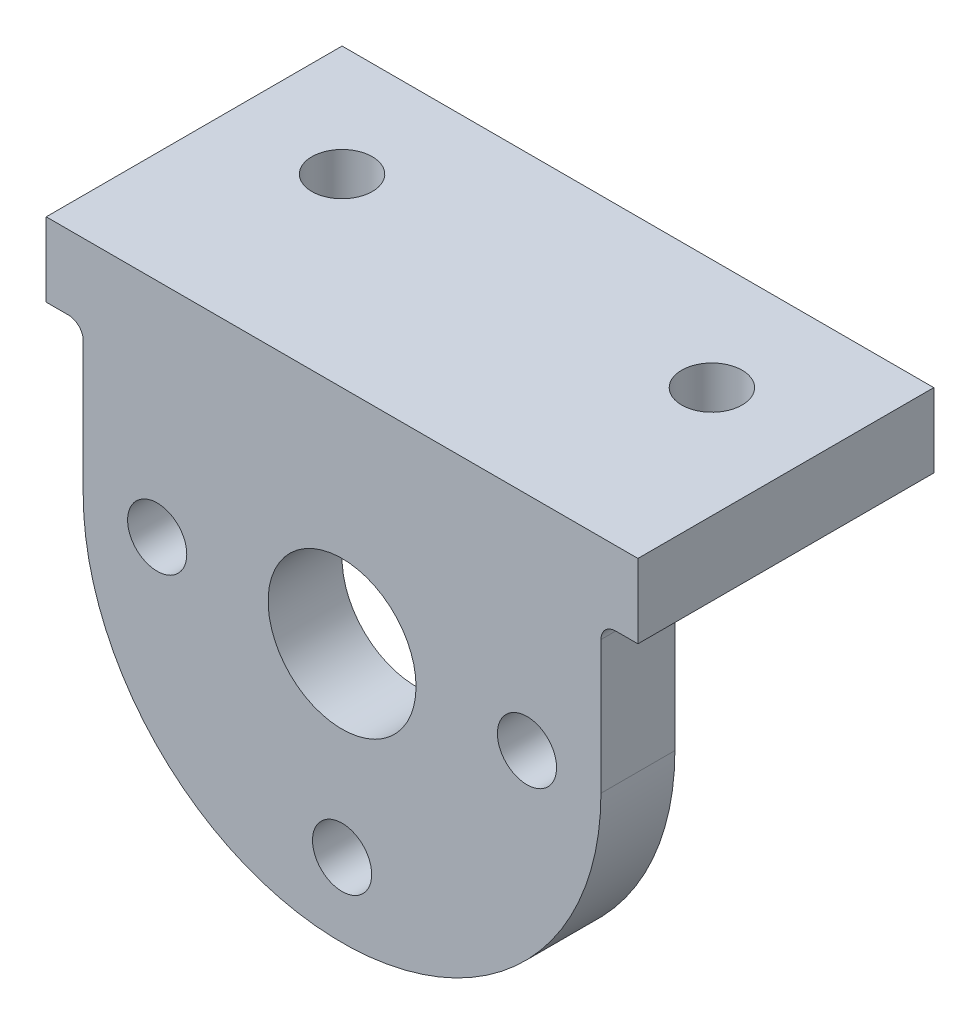
ISO-10303-21;
HEADER;
FILE_DESCRIPTION(('STEP AP214'),'2;1');
FILE_NAME('part.step','',(''),(''),'','','');
FILE_SCHEMA(('AUTOMOTIVE_DESIGN { 1 0 10303 214 1 1 1 1 }'));
ENDSEC;
DATA;
#1=APPLICATION_CONTEXT('core data for automotive mechanical design processes');
#2=APPLICATION_PROTOCOL_DEFINITION('international standard','automotive_design',2000,#1);
#3=PRODUCT_CONTEXT('',#1,'mechanical');
#4=PRODUCT('Part','Part','',(#3));
#5=PRODUCT_RELATED_PRODUCT_CATEGORY('part','',(#4));
#6=PRODUCT_DEFINITION_FORMATION('','',#4);
#7=PRODUCT_DEFINITION_CONTEXT('part definition',#1,'design');
#8=PRODUCT_DEFINITION('design','',#6,#7);
#9=PRODUCT_DEFINITION_SHAPE('','',#8);
#10=(LENGTH_UNIT() NAMED_UNIT(*) SI_UNIT(.MILLI.,.METRE.));
#11=(NAMED_UNIT(*) PLANE_ANGLE_UNIT() SI_UNIT($,.RADIAN.));
#12=(NAMED_UNIT(*) SI_UNIT($,.STERADIAN.) SOLID_ANGLE_UNIT());
#13=UNCERTAINTY_MEASURE_WITH_UNIT(LENGTH_MEASURE(1.E-05),#10,'distance_accuracy_value','');
#14=(GEOMETRIC_REPRESENTATION_CONTEXT(3) GLOBAL_UNCERTAINTY_ASSIGNED_CONTEXT((#13)) GLOBAL_UNIT_ASSIGNED_CONTEXT((#10,
#11,#12)) REPRESENTATION_CONTEXT('',''));
#15=CARTESIAN_POINT('',(0.,0.,0.));
#16=DIRECTION('',(0.,0.,1.));
#17=DIRECTION('',(1.,0.,0.));
#18=AXIS2_PLACEMENT_3D('',#15,#16,#17);
#19=CARTESIAN_POINT('',(-44.45,0.,12.7));
#20=DIRECTION('',(1.,0.,0.));
#21=DIRECTION('',(0.,1.,0.));
#22=AXIS2_PLACEMENT_3D('',#19,#20,#21);
#23=PLANE('',#22);
#24=DIRECTION('',(0.,-1.,0.));
#25=VECTOR('',#24,1.);
#26=CARTESIAN_POINT('',(-44.45,0.,12.7));
#27=LINE('',#26,#25);
#28=CARTESIAN_POINT('',(-44.45,-15.24,12.7));
#29=VERTEX_POINT('',#28);
#30=CARTESIAN_POINT('',(-44.45,-38.1,12.7));
#31=VERTEX_POINT('',#30);
#32=EDGE_CURVE('E172',#29,#31,#27,.T.);
#33=ORIENTED_EDGE('',*,*,#32,.F.);
#34=DIRECTION('',(0.,0.,-1.));
#35=VECTOR('',#34,1.);
#36=CARTESIAN_POINT('',(-44.45,-15.24,0.));
#37=LINE('',#36,#35);
#38=CARTESIAN_POINT('',(-44.45,-15.24,0.));
#39=VERTEX_POINT('',#38);
#40=EDGE_CURVE('E69',#29,#39,#37,.T.);
#41=ORIENTED_EDGE('',*,*,#40,.T.);
#42=DIRECTION('',(0.,-1.,0.));
#43=VECTOR('',#42,1.);
#44=CARTESIAN_POINT('',(-44.45,0.,0.));
#45=LINE('',#44,#43);
#46=CARTESIAN_POINT('',(-44.45,-38.1,0.));
#47=VERTEX_POINT('',#46);
#48=EDGE_CURVE('E171',#39,#47,#45,.T.);
#49=ORIENTED_EDGE('',*,*,#48,.T.);
#50=DIRECTION('',(0.,0.,-1.));
#51=VECTOR('',#50,1.);
#52=CARTESIAN_POINT('',(-44.45,-38.1,12.7));
#53=LINE('',#52,#51);
#54=EDGE_CURVE('E213',#31,#47,#53,.T.);
#55=ORIENTED_EDGE('',*,*,#54,.F.);
#56=EDGE_LOOP('',(#33,#41,#49,#55));
#57=FACE_BOUND('',#56,.T.);
#58=ADVANCED_FACE('F46',(#57),#23,.F.);
#59=CARTESIAN_POINT('',(0.,-38.1,12.7));
#60=DIRECTION('',(0.,0.,-1.));
#61=DIRECTION('',(-1.,0.,0.));
#62=AXIS2_PLACEMENT_3D('',#59,#60,#61);
#63=CYLINDRICAL_SURFACE('',#62,44.45);
#64=CARTESIAN_POINT('',(0.,-38.1,0.));
#65=DIRECTION('',(0.,0.,1.));
#66=DIRECTION('',(1.,0.,0.));
#67=AXIS2_PLACEMENT_3D('',#64,#65,#66);
#68=CIRCLE('',#67,44.45);
#69=CARTESIAN_POINT('',(44.45,-38.1,0.));
#70=VERTEX_POINT('',#69);
#71=EDGE_CURVE('E197',#47,#70,#68,.T.);
#72=ORIENTED_EDGE('',*,*,#71,.T.);
#73=DIRECTION('',(0.,0.,-1.));
#74=VECTOR('',#73,1.);
#75=CARTESIAN_POINT('',(44.45,-38.1,12.7));
#76=LINE('',#75,#74);
#77=CARTESIAN_POINT('',(44.45,-38.1,12.7));
#78=VERTEX_POINT('',#77);
#79=EDGE_CURVE('E137',#78,#70,#76,.T.);
#80=ORIENTED_EDGE('',*,*,#79,.F.);
#81=CARTESIAN_POINT('',(0.,-38.1,12.7));
#82=DIRECTION('',(0.,0.,1.));
#83=DIRECTION('',(1.,0.,0.));
#84=AXIS2_PLACEMENT_3D('',#81,#82,#83);
#85=CIRCLE('',#84,44.45);
#86=EDGE_CURVE('E175',#31,#78,#85,.T.);
#87=ORIENTED_EDGE('',*,*,#86,.F.);
#88=ORIENTED_EDGE('',*,*,#54,.T.);
#89=EDGE_LOOP('',(#72,#80,#87,#88));
#90=FACE_BOUND('',#89,.T.);
#91=ADVANCED_FACE('F313',(#90),#63,.T.);
#92=CARTESIAN_POINT('',(44.45,0.,12.7));
#93=DIRECTION('',(1.,0.,0.));
#94=DIRECTION('',(0.,1.,0.));
#95=AXIS2_PLACEMENT_3D('',#92,#93,#94);
#96=PLANE('',#95);
#97=DIRECTION('',(0.,-1.,0.));
#98=VECTOR('',#97,1.);
#99=CARTESIAN_POINT('',(44.45,0.,0.));
#100=LINE('',#99,#98);
#101=CARTESIAN_POINT('',(44.45,-15.24,0.));
#102=VERTEX_POINT('',#101);
#103=EDGE_CURVE('E176',#102,#70,#100,.T.);
#104=ORIENTED_EDGE('',*,*,#103,.F.);
#105=DIRECTION('',(0.,0.,-1.));
#106=VECTOR('',#105,1.);
#107=CARTESIAN_POINT('',(44.45,-15.24,12.7));
#108=LINE('',#107,#106);
#109=CARTESIAN_POINT('',(44.45,-15.24,12.7));
#110=VERTEX_POINT('',#109);
#111=EDGE_CURVE('E238',#102,#110,#108,.F.);
#112=ORIENTED_EDGE('',*,*,#111,.T.);
#113=DIRECTION('',(0.,-1.,0.));
#114=VECTOR('',#113,1.);
#115=CARTESIAN_POINT('',(44.45,0.,12.7));
#116=LINE('',#115,#114);
#117=EDGE_CURVE('E180',#110,#78,#116,.T.);
#118=ORIENTED_EDGE('',*,*,#117,.T.);
#119=ORIENTED_EDGE('',*,*,#79,.T.);
#120=EDGE_LOOP('',(#104,#112,#118,#119));
#121=FACE_BOUND('',#120,.T.);
#122=ADVANCED_FACE('F319',(#121),#96,.T.);
#123=CARTESIAN_POINT('',(50.8,0.,12.7));
#124=DIRECTION('',(1.,0.,0.));
#125=DIRECTION('',(0.,0.,-1.));
#126=AXIS2_PLACEMENT_3D('',#123,#124,#125);
#127=PLANE('',#126);
#128=DIRECTION('',(0.,0.,-1.));
#129=VECTOR('',#128,1.);
#130=CARTESIAN_POINT('',(50.8,-12.7,12.7));
#131=LINE('',#130,#129);
#132=CARTESIAN_POINT('',(50.8,-12.7,12.7));
#133=VERTEX_POINT('',#132);
#134=CARTESIAN_POINT('',(50.8,-12.7,-38.1));
#135=VERTEX_POINT('',#134);
#136=EDGE_CURVE('E126',#133,#135,#131,.T.);
#137=ORIENTED_EDGE('',*,*,#136,.T.);
#138=DIRECTION('',(0.,-1.,0.));
#139=VECTOR('',#138,1.);
#140=CARTESIAN_POINT('',(50.8,0.,-38.1));
#141=LINE('',#140,#139);
#142=CARTESIAN_POINT('',(50.8,0.,-38.1));
#143=VERTEX_POINT('',#142);
#144=EDGE_CURVE('E129',#143,#135,#141,.T.);
#145=ORIENTED_EDGE('',*,*,#144,.F.);
#146=DIRECTION('',(0.,0.,-1.));
#147=VECTOR('',#146,1.);
#148=CARTESIAN_POINT('',(50.8,0.,12.7));
#149=LINE('',#148,#147);
#150=CARTESIAN_POINT('',(50.8,0.,12.7));
#151=VERTEX_POINT('',#150);
#152=EDGE_CURVE('E138',#151,#143,#149,.T.);
#153=ORIENTED_EDGE('',*,*,#152,.F.);
#154=DIRECTION('',(0.,-1.,0.));
#155=VECTOR('',#154,1.);
#156=CARTESIAN_POINT('',(50.8,0.,12.7));
#157=LINE('',#156,#155);
#158=EDGE_CURVE('E132',#151,#133,#157,.T.);
#159=ORIENTED_EDGE('',*,*,#158,.T.);
#160=EDGE_LOOP('',(#137,#145,#153,#159));
#161=FACE_BOUND('',#160,.T.);
#162=ADVANCED_FACE('F128',(#161),#127,.T.);
#163=CARTESIAN_POINT('',(0.,0.,12.7));
#164=DIRECTION('',(0.,-1.,0.));
#165=DIRECTION('',(0.,0.,-1.));
#166=AXIS2_PLACEMENT_3D('',#163,#164,#165);
#167=PLANE('',#166);
#168=CARTESIAN_POINT('',(-31.75,0.,-19.05));
#169=DIRECTION('',(0.,-1.,0.));
#170=DIRECTION('',(1.,0.,0.));
#171=AXIS2_PLACEMENT_3D('',#168,#169,#170);
#172=CIRCLE('',#171,5.18795);
#173=CARTESIAN_POINT('',(-26.56205,0.,-19.05));
#174=VERTEX_POINT('',#173);
#175=EDGE_CURVE('E282',#174,#174,#172,.T.);
#176=ORIENTED_EDGE('',*,*,#175,.T.);
#177=EDGE_LOOP('',(#176));
#178=FACE_BOUND('',#177,.T.);
#179=CARTESIAN_POINT('',(31.75,0.,-19.05));
#180=DIRECTION('',(0.,-1.,0.));
#181=DIRECTION('',(1.,0.,0.));
#182=AXIS2_PLACEMENT_3D('',#179,#180,#181);
#183=CIRCLE('',#182,5.18795);
#184=CARTESIAN_POINT('',(36.93795,0.,-19.05));
#185=VERTEX_POINT('',#184);
#186=EDGE_CURVE('E262',#185,#185,#183,.T.);
#187=ORIENTED_EDGE('',*,*,#186,.T.);
#188=EDGE_LOOP('',(#187));
#189=FACE_BOUND('',#188,.T.);
#190=ORIENTED_EDGE('',*,*,#152,.T.);
#191=DIRECTION('',(-1.,0.,0.));
#192=VECTOR('',#191,1.);
#193=CARTESIAN_POINT('',(0.,0.,-38.1));
#194=LINE('',#193,#192);
#195=CARTESIAN_POINT('',(-50.8,0.,-38.1));
#196=VERTEX_POINT('',#195);
#197=EDGE_CURVE('E147',#143,#196,#194,.T.);
#198=ORIENTED_EDGE('',*,*,#197,.T.);
#199=DIRECTION('',(0.,0.,-1.));
#200=VECTOR('',#199,1.);
#201=CARTESIAN_POINT('',(-50.8,0.,12.7));
#202=LINE('',#201,#200);
#203=CARTESIAN_POINT('',(-50.8,0.,12.7));
#204=VERTEX_POINT('',#203);
#205=EDGE_CURVE('E205',#204,#196,#202,.T.);
#206=ORIENTED_EDGE('',*,*,#205,.F.);
#207=DIRECTION('',(-1.,0.,0.));
#208=VECTOR('',#207,1.);
#209=CARTESIAN_POINT('',(0.,0.,12.7));
#210=LINE('',#209,#208);
#211=EDGE_CURVE('E189',#151,#204,#210,.T.);
#212=ORIENTED_EDGE('',*,*,#211,.F.);
#213=EDGE_LOOP('',(#190,#198,#206,#212));
#214=FACE_BOUND('',#213,.T.);
#215=ADVANCED_FACE('F308',(#178,#189,#214),#167,.F.);
#216=CARTESIAN_POINT('',(-50.8,0.,12.7));
#217=DIRECTION('',(1.,0.,0.));
#218=DIRECTION('',(0.,0.,-1.));
#219=AXIS2_PLACEMENT_3D('',#216,#217,#218);
#220=PLANE('',#219);
#221=ORIENTED_EDGE('',*,*,#205,.T.);
#222=DIRECTION('',(0.,-1.,0.));
#223=VECTOR('',#222,1.);
#224=CARTESIAN_POINT('',(-50.8,0.,-38.1));
#225=LINE('',#224,#223);
#226=CARTESIAN_POINT('',(-50.8,-12.7,-38.1));
#227=VERTEX_POINT('',#226);
#228=EDGE_CURVE('E168',#196,#227,#225,.T.);
#229=ORIENTED_EDGE('',*,*,#228,.T.);
#230=DIRECTION('',(0.,0.,-1.));
#231=VECTOR('',#230,1.);
#232=CARTESIAN_POINT('',(-50.8,-12.7,12.7));
#233=LINE('',#232,#231);
#234=CARTESIAN_POINT('',(-50.8,-12.7,12.7));
#235=VERTEX_POINT('',#234);
#236=EDGE_CURVE('E154',#235,#227,#233,.T.);
#237=ORIENTED_EDGE('',*,*,#236,.F.);
#238=DIRECTION('',(0.,-1.,0.));
#239=VECTOR('',#238,1.);
#240=CARTESIAN_POINT('',(-50.8,0.,12.7));
#241=LINE('',#240,#239);
#242=EDGE_CURVE('E192',#204,#235,#241,.T.);
#243=ORIENTED_EDGE('',*,*,#242,.F.);
#244=EDGE_LOOP('',(#221,#229,#237,#243));
#245=FACE_BOUND('',#244,.T.);
#246=ADVANCED_FACE('F298',(#245),#220,.F.);
#247=CARTESIAN_POINT('',(0.,-12.7,12.7));
#248=DIRECTION('',(0.,1.,0.));
#249=DIRECTION('',(-1.,0.,0.));
#250=AXIS2_PLACEMENT_3D('',#247,#248,#249);
#251=PLANE('',#250);
#252=DIRECTION('',(1.,0.,0.));
#253=VECTOR('',#252,1.);
#254=CARTESIAN_POINT('',(0.,-12.7,12.7));
#255=LINE('',#254,#253);
#256=CARTESIAN_POINT('',(46.99,-12.7,12.7));
#257=VERTEX_POINT('',#256);
#258=EDGE_CURVE('E183',#257,#133,#255,.T.);
#259=ORIENTED_EDGE('',*,*,#258,.F.);
#260=DIRECTION('',(0.,0.,-1.));
#261=VECTOR('',#260,1.);
#262=CARTESIAN_POINT('',(46.99,-12.7,12.7));
#263=LINE('',#262,#261);
#264=CARTESIAN_POINT('',(46.99,-12.7,-2.54));
#265=VERTEX_POINT('',#264);
#266=EDGE_CURVE('E234',#257,#265,#263,.T.);
#267=ORIENTED_EDGE('',*,*,#266,.T.);
#268=DIRECTION('',(1.,0.,0.));
#269=VECTOR('',#268,1.);
#270=CARTESIAN_POINT('',(-44.45,-12.7,-2.54));
#271=LINE('',#270,#269);
#272=CARTESIAN_POINT('',(-46.99,-12.7,-2.54));
#273=VERTEX_POINT('',#272);
#274=EDGE_CURVE('E217',#265,#273,#271,.F.);
#275=ORIENTED_EDGE('',*,*,#274,.T.);
#276=DIRECTION('',(0.,0.,-1.));
#277=VECTOR('',#276,1.);
#278=CARTESIAN_POINT('',(-46.99,-12.7,12.7));
#279=LINE('',#278,#277);
#280=CARTESIAN_POINT('',(-46.99,-12.7,12.7));
#281=VERTEX_POINT('',#280);
#282=EDGE_CURVE('E231',#273,#281,#279,.F.);
#283=ORIENTED_EDGE('',*,*,#282,.T.);
#284=EDGE_CURVE('E186',#235,#281,#255,.T.);
#285=ORIENTED_EDGE('',*,*,#284,.F.);
#286=ORIENTED_EDGE('',*,*,#236,.T.);
#287=DIRECTION('',(1.,0.,0.));
#288=VECTOR('',#287,1.);
#289=CARTESIAN_POINT('',(0.,-12.7,-38.1));
#290=LINE('',#289,#288);
#291=EDGE_CURVE('E144',#227,#135,#290,.T.);
#292=ORIENTED_EDGE('',*,*,#291,.T.);
#293=ORIENTED_EDGE('',*,*,#136,.F.);
#294=EDGE_LOOP('',(#259,#267,#275,#283,#285,#286,#292,#293));
#295=FACE_BOUND('',#294,.T.);
#296=CARTESIAN_POINT('',(-31.75,-12.7,-19.05));
#297=DIRECTION('',(0.,-1.,0.));
#298=DIRECTION('',(1.,0.,0.));
#299=AXIS2_PLACEMENT_3D('',#296,#297,#298);
#300=CIRCLE('',#299,5.18795);
#301=CARTESIAN_POINT('',(-26.56205,-12.7,-19.05));
#302=VERTEX_POINT('',#301);
#303=EDGE_CURVE('E268',#302,#302,#300,.T.);
#304=ORIENTED_EDGE('',*,*,#303,.F.);
#305=EDGE_LOOP('',(#304));
#306=FACE_BOUND('',#305,.T.);
#307=CARTESIAN_POINT('',(31.75,-12.7,-19.05));
#308=DIRECTION('',(0.,-1.,0.));
#309=DIRECTION('',(1.,0.,0.));
#310=AXIS2_PLACEMENT_3D('',#307,#308,#309);
#311=CIRCLE('',#310,5.18795);
#312=CARTESIAN_POINT('',(36.93795,-12.7,-19.05));
#313=VERTEX_POINT('',#312);
#314=EDGE_CURVE('E256',#313,#313,#311,.T.);
#315=ORIENTED_EDGE('',*,*,#314,.F.);
#316=EDGE_LOOP('',(#315));
#317=FACE_BOUND('',#316,.T.);
#318=ADVANCED_FACE('F150',(#295,#306,#317),#251,.F.);
#319=CARTESIAN_POINT('',(0.,0.,12.7));
#320=DIRECTION('',(0.,0.,1.));
#321=DIRECTION('',(1.,0.,0.));
#322=AXIS2_PLACEMENT_3D('',#319,#320,#321);
#323=PLANE('',#322);
#324=CARTESIAN_POINT('',(0.,-69.85,12.7));
#325=DIRECTION('',(0.,0.,1.));
#326=DIRECTION('',(1.,0.,0.));
#327=AXIS2_PLACEMENT_3D('',#324,#325,#326);
#328=CIRCLE('',#327,5.08000000000001);
#329=CARTESIAN_POINT('',(5.08000000000001,-69.85,12.7));
#330=VERTEX_POINT('',#329);
#331=EDGE_CURVE('E279',#330,#330,#328,.T.);
#332=ORIENTED_EDGE('',*,*,#331,.F.);
#333=EDGE_LOOP('',(#332));
#334=FACE_BOUND('',#333,.T.);
#335=CARTESIAN_POINT('',(31.75,-38.1,12.7));
#336=DIRECTION('',(0.,0.,1.));
#337=DIRECTION('',(1.,0.,0.));
#338=AXIS2_PLACEMENT_3D('',#335,#336,#337);
#339=CIRCLE('',#338,5.08000000000001);
#340=CARTESIAN_POINT('',(36.83,-38.1,12.7));
#341=VERTEX_POINT('',#340);
#342=EDGE_CURVE('E276',#341,#341,#339,.T.);
#343=ORIENTED_EDGE('',*,*,#342,.F.);
#344=EDGE_LOOP('',(#343));
#345=FACE_BOUND('',#344,.T.);
#346=CARTESIAN_POINT('',(-31.75,-38.1,12.7));
#347=DIRECTION('',(0.,0.,1.));
#348=DIRECTION('',(1.,0.,0.));
#349=AXIS2_PLACEMENT_3D('',#346,#347,#348);
#350=CIRCLE('',#349,5.08);
#351=CARTESIAN_POINT('',(-26.67,-38.1,12.7));
#352=VERTEX_POINT('',#351);
#353=EDGE_CURVE('E272',#352,#352,#350,.T.);
#354=ORIENTED_EDGE('',*,*,#353,.F.);
#355=EDGE_LOOP('',(#354));
#356=FACE_BOUND('',#355,.T.);
#357=CARTESIAN_POINT('',(0.,-38.1,12.7));
#358=DIRECTION('',(0.,0.,1.));
#359=DIRECTION('',(1.,0.,0.));
#360=AXIS2_PLACEMENT_3D('',#357,#358,#359);
#361=CIRCLE('',#360,12.7);
#362=CARTESIAN_POINT('',(12.7,-38.1,12.7));
#363=VERTEX_POINT('',#362);
#364=EDGE_CURVE('E163',#363,#363,#361,.T.);
#365=ORIENTED_EDGE('',*,*,#364,.F.);
#366=EDGE_LOOP('',(#365));
#367=FACE_BOUND('',#366,.T.);
#368=ORIENTED_EDGE('',*,*,#284,.T.);
#369=CARTESIAN_POINT('',(-46.99,-15.24,12.7));
#370=DIRECTION('',(0.,0.,1.));
#371=DIRECTION('',(1.,0.,0.));
#372=AXIS2_PLACEMENT_3D('',#369,#370,#371);
#373=CIRCLE('',#372,2.54);
#374=EDGE_CURVE('E11',#281,#29,#373,.F.);
#375=ORIENTED_EDGE('',*,*,#374,.T.);
#376=ORIENTED_EDGE('',*,*,#32,.T.);
#377=ORIENTED_EDGE('',*,*,#86,.T.);
#378=ORIENTED_EDGE('',*,*,#117,.F.);
#379=CARTESIAN_POINT('',(46.99,-15.24,12.7));
#380=DIRECTION('',(0.,0.,1.));
#381=DIRECTION('',(1.,0.,0.));
#382=AXIS2_PLACEMENT_3D('',#379,#380,#381);
#383=CIRCLE('',#382,2.54);
#384=EDGE_CURVE('E56',#110,#257,#383,.F.);
#385=ORIENTED_EDGE('',*,*,#384,.T.);
#386=ORIENTED_EDGE('',*,*,#258,.T.);
#387=ORIENTED_EDGE('',*,*,#158,.F.);
#388=ORIENTED_EDGE('',*,*,#211,.T.);
#389=ORIENTED_EDGE('',*,*,#242,.T.);
#390=EDGE_LOOP('',(#368,#375,#376,#377,#378,#385,#386,#387,#388,#389));
#391=FACE_BOUND('',#390,.T.);
#392=ADVANCED_FACE('F297',(#334,#345,#356,#367,#391),#323,.T.);
#393=CARTESIAN_POINT('',(0.,0.,0.));
#394=DIRECTION('',(0.,0.,1.));
#395=DIRECTION('',(1.,0.,0.));
#396=AXIS2_PLACEMENT_3D('',#393,#394,#395);
#397=PLANE('',#396);
#398=CARTESIAN_POINT('',(0.,-69.85,0.));
#399=DIRECTION('',(0.,0.,1.));
#400=DIRECTION('',(1.,0.,0.));
#401=AXIS2_PLACEMENT_3D('',#398,#399,#400);
#402=CIRCLE('',#401,5.08000000000001);
#403=CARTESIAN_POINT('',(5.08000000000001,-69.85,0.));
#404=VERTEX_POINT('',#403);
#405=EDGE_CURVE('E156',#404,#404,#402,.T.);
#406=ORIENTED_EDGE('',*,*,#405,.T.);
#407=EDGE_LOOP('',(#406));
#408=FACE_BOUND('',#407,.T.);
#409=CARTESIAN_POINT('',(31.75,-38.1,0.));
#410=DIRECTION('',(0.,0.,1.));
#411=DIRECTION('',(1.,0.,0.));
#412=AXIS2_PLACEMENT_3D('',#409,#410,#411);
#413=CIRCLE('',#412,5.08000000000001);
#414=CARTESIAN_POINT('',(36.83,-38.1,0.));
#415=VERTEX_POINT('',#414);
#416=EDGE_CURVE('E160',#415,#415,#413,.T.);
#417=ORIENTED_EDGE('',*,*,#416,.T.);
#418=EDGE_LOOP('',(#417));
#419=FACE_BOUND('',#418,.T.);
#420=CARTESIAN_POINT('',(-31.75,-38.1,0.));
#421=DIRECTION('',(0.,0.,1.));
#422=DIRECTION('',(1.,0.,0.));
#423=AXIS2_PLACEMENT_3D('',#420,#421,#422);
#424=CIRCLE('',#423,5.08);
#425=CARTESIAN_POINT('',(-26.67,-38.1,0.));
#426=VERTEX_POINT('',#425);
#427=EDGE_CURVE('E222',#426,#426,#424,.T.);
#428=ORIENTED_EDGE('',*,*,#427,.T.);
#429=EDGE_LOOP('',(#428));
#430=FACE_BOUND('',#429,.T.);
#431=CARTESIAN_POINT('',(0.,-38.1,0.));
#432=DIRECTION('',(0.,0.,1.));
#433=DIRECTION('',(1.,0.,0.));
#434=AXIS2_PLACEMENT_3D('',#431,#432,#433);
#435=CIRCLE('',#434,12.7);
#436=CARTESIAN_POINT('',(12.7,-38.1,0.));
#437=VERTEX_POINT('',#436);
#438=EDGE_CURVE('E218',#437,#437,#435,.T.);
#439=ORIENTED_EDGE('',*,*,#438,.T.);
#440=EDGE_LOOP('',(#439));
#441=FACE_BOUND('',#440,.T.);
#442=ORIENTED_EDGE('',*,*,#48,.F.);
#443=DIRECTION('',(1.,0.,0.));
#444=VECTOR('',#443,1.);
#445=CARTESIAN_POINT('',(44.45,-15.24,0.));
#446=LINE('',#445,#444);
#447=EDGE_CURVE('E243',#39,#102,#446,.T.);
#448=ORIENTED_EDGE('',*,*,#447,.T.);
#449=ORIENTED_EDGE('',*,*,#103,.T.);
#450=ORIENTED_EDGE('',*,*,#71,.F.);
#451=EDGE_LOOP('',(#442,#448,#449,#450));
#452=FACE_BOUND('',#451,.T.);
#453=ADVANCED_FACE('F304',(#408,#419,#430,#441,#452),#397,.F.);
#454=CARTESIAN_POINT('',(0.,0.,-38.1));
#455=DIRECTION('',(0.,0.,1.));
#456=DIRECTION('',(1.,0.,0.));
#457=AXIS2_PLACEMENT_3D('',#454,#455,#456);
#458=PLANE('',#457);
#459=ORIENTED_EDGE('',*,*,#291,.F.);
#460=ORIENTED_EDGE('',*,*,#228,.F.);
#461=ORIENTED_EDGE('',*,*,#197,.F.);
#462=ORIENTED_EDGE('',*,*,#144,.T.);
#463=EDGE_LOOP('',(#459,#460,#461,#462));
#464=FACE_BOUND('',#463,.T.);
#465=ADVANCED_FACE('F142',(#464),#458,.F.);
#466=CARTESIAN_POINT('',(0.,-38.1,-38.1));
#467=DIRECTION('',(0.,0.,1.));
#468=DIRECTION('',(1.,0.,0.));
#469=AXIS2_PLACEMENT_3D('',#466,#467,#468);
#470=CYLINDRICAL_SURFACE('',#469,12.7);
#471=ORIENTED_EDGE('',*,*,#364,.T.);
#472=EDGE_LOOP('',(#471));
#473=FACE_BOUND('',#472,.T.);
#474=ORIENTED_EDGE('',*,*,#438,.F.);
#475=EDGE_LOOP('',(#474));
#476=FACE_BOUND('',#475,.T.);
#477=ADVANCED_FACE('F434',(#473,#476),#470,.F.);
#478=CARTESIAN_POINT('',(-31.75,-38.1,-38.1));
#479=DIRECTION('',(0.,0.,1.));
#480=DIRECTION('',(1.,0.,0.));
#481=AXIS2_PLACEMENT_3D('',#478,#479,#480);
#482=CYLINDRICAL_SURFACE('',#481,5.08);
#483=ORIENTED_EDGE('',*,*,#353,.T.);
#484=EDGE_LOOP('',(#483));
#485=FACE_BOUND('',#484,.T.);
#486=ORIENTED_EDGE('',*,*,#427,.F.);
#487=EDGE_LOOP('',(#486));
#488=FACE_BOUND('',#487,.T.);
#489=ADVANCED_FACE('F442',(#485,#488),#482,.F.);
#490=CARTESIAN_POINT('',(31.75,-38.1,-38.1));
#491=DIRECTION('',(0.,0.,1.));
#492=DIRECTION('',(1.,0.,0.));
#493=AXIS2_PLACEMENT_3D('',#490,#491,#492);
#494=CYLINDRICAL_SURFACE('',#493,5.08000000000001);
#495=ORIENTED_EDGE('',*,*,#342,.T.);
#496=EDGE_LOOP('',(#495));
#497=FACE_BOUND('',#496,.T.);
#498=ORIENTED_EDGE('',*,*,#416,.F.);
#499=EDGE_LOOP('',(#498));
#500=FACE_BOUND('',#499,.T.);
#501=ADVANCED_FACE('F451',(#497,#500),#494,.F.);
#502=CARTESIAN_POINT('',(0.,-69.85,-38.1));
#503=DIRECTION('',(0.,0.,1.));
#504=DIRECTION('',(1.,0.,0.));
#505=AXIS2_PLACEMENT_3D('',#502,#503,#504);
#506=CYLINDRICAL_SURFACE('',#505,5.08000000000001);
#507=ORIENTED_EDGE('',*,*,#331,.T.);
#508=EDGE_LOOP('',(#507));
#509=FACE_BOUND('',#508,.T.);
#510=ORIENTED_EDGE('',*,*,#405,.F.);
#511=EDGE_LOOP('',(#510));
#512=FACE_BOUND('',#511,.T.);
#513=ADVANCED_FACE('F460',(#509,#512),#506,.F.);
#514=CARTESIAN_POINT('',(31.75,0.,-19.05));
#515=DIRECTION('',(0.,-1.,0.));
#516=DIRECTION('',(1.,0.,0.));
#517=AXIS2_PLACEMENT_3D('',#514,#515,#516);
#518=CYLINDRICAL_SURFACE('',#517,5.18795);
#519=ORIENTED_EDGE('',*,*,#186,.F.);
#520=EDGE_LOOP('',(#519));
#521=FACE_BOUND('',#520,.T.);
#522=ORIENTED_EDGE('',*,*,#314,.T.);
#523=EDGE_LOOP('',(#522));
#524=FACE_BOUND('',#523,.T.);
#525=ADVANCED_FACE('F335',(#521,#524),#518,.F.);
#526=CARTESIAN_POINT('',(-31.75,0.,-19.05));
#527=DIRECTION('',(0.,-1.,0.));
#528=DIRECTION('',(1.,0.,0.));
#529=AXIS2_PLACEMENT_3D('',#526,#527,#528);
#530=CYLINDRICAL_SURFACE('',#529,5.18795);
#531=ORIENTED_EDGE('',*,*,#175,.F.);
#532=EDGE_LOOP('',(#531));
#533=FACE_BOUND('',#532,.T.);
#534=ORIENTED_EDGE('',*,*,#303,.T.);
#535=EDGE_LOOP('',(#534));
#536=FACE_BOUND('',#535,.T.);
#537=ADVANCED_FACE('F294',(#533,#536),#530,.F.);
#538=CARTESIAN_POINT('',(-46.99,-15.24,12.7));
#539=DIRECTION('',(0.,0.,1.));
#540=DIRECTION('',(1.,0.,0.));
#541=AXIS2_PLACEMENT_3D('',#538,#539,#540);
#542=CYLINDRICAL_SURFACE('',#541,2.54);
#543=ORIENTED_EDGE('',*,*,#374,.F.);
#544=ORIENTED_EDGE('',*,*,#282,.F.);
#545=CARTESIAN_POINT('',(-46.99,-15.24,-2.54));
#546=DIRECTION('',(-0.707106781186547,0.,0.707106781186547));
#547=DIRECTION('',(-0.707106781186547,0.,-0.707106781186547));
#548=AXIS2_PLACEMENT_3D('',#545,#546,#547);
#549=ELLIPSE('',#548,3.59210244842766,2.54);
#550=EDGE_CURVE('E50',#39,#273,#549,.T.);
#551=ORIENTED_EDGE('',*,*,#550,.F.);
#552=ORIENTED_EDGE('',*,*,#40,.F.);
#553=EDGE_LOOP('',(#543,#544,#551,#552));
#554=FACE_BOUND('',#553,.T.);
#555=ADVANCED_FACE('F48',(#554),#542,.F.);
#556=CARTESIAN_POINT('',(0.,-15.24,-2.54));
#557=DIRECTION('',(-1.,0.,0.));
#558=DIRECTION('',(0.,-1.,0.));
#559=AXIS2_PLACEMENT_3D('',#556,#557,#558);
#560=CYLINDRICAL_SURFACE('',#559,2.54);
#561=ORIENTED_EDGE('',*,*,#550,.T.);
#562=ORIENTED_EDGE('',*,*,#274,.F.);
#563=CARTESIAN_POINT('',(46.99,-15.24,-2.54));
#564=DIRECTION('',(-0.707106781186547,0.,-0.707106781186547));
#565=DIRECTION('',(-0.707106781186547,0.,0.707106781186547));
#566=AXIS2_PLACEMENT_3D('',#563,#564,#565);
#567=ELLIPSE('',#566,3.59210244842766,2.54);
#568=EDGE_CURVE('E247',#102,#265,#567,.T.);
#569=ORIENTED_EDGE('',*,*,#568,.F.);
#570=ORIENTED_EDGE('',*,*,#447,.F.);
#571=EDGE_LOOP('',(#561,#562,#569,#570));
#572=FACE_BOUND('',#571,.T.);
#573=ADVANCED_FACE('F326',(#572),#560,.F.);
#574=CARTESIAN_POINT('',(46.99,-15.24,12.7));
#575=DIRECTION('',(0.,0.,-1.));
#576=DIRECTION('',(-1.,0.,0.));
#577=AXIS2_PLACEMENT_3D('',#574,#575,#576);
#578=CYLINDRICAL_SURFACE('',#577,2.54);
#579=ORIENTED_EDGE('',*,*,#384,.F.);
#580=ORIENTED_EDGE('',*,*,#111,.F.);
#581=ORIENTED_EDGE('',*,*,#568,.T.);
#582=ORIENTED_EDGE('',*,*,#266,.F.);
#583=EDGE_LOOP('',(#579,#580,#581,#582));
#584=FACE_BOUND('',#583,.T.);
#585=ADVANCED_FACE('F324',(#584),#578,.F.);
#586=CLOSED_SHELL('',(#58,#91,#122,#162,#215,#246,#318,#392,#453,#465,#477,#489,#501,#513,#525,
#537,#555,#573,#585));
#587=MANIFOLD_SOLID_BREP('B2',#586);
#588=ADVANCED_BREP_SHAPE_REPRESENTATION('',(#18,#587),#14);
#589=SHAPE_DEFINITION_REPRESENTATION(#9,#588);
ENDSEC;
END-ISO-10303-21;
